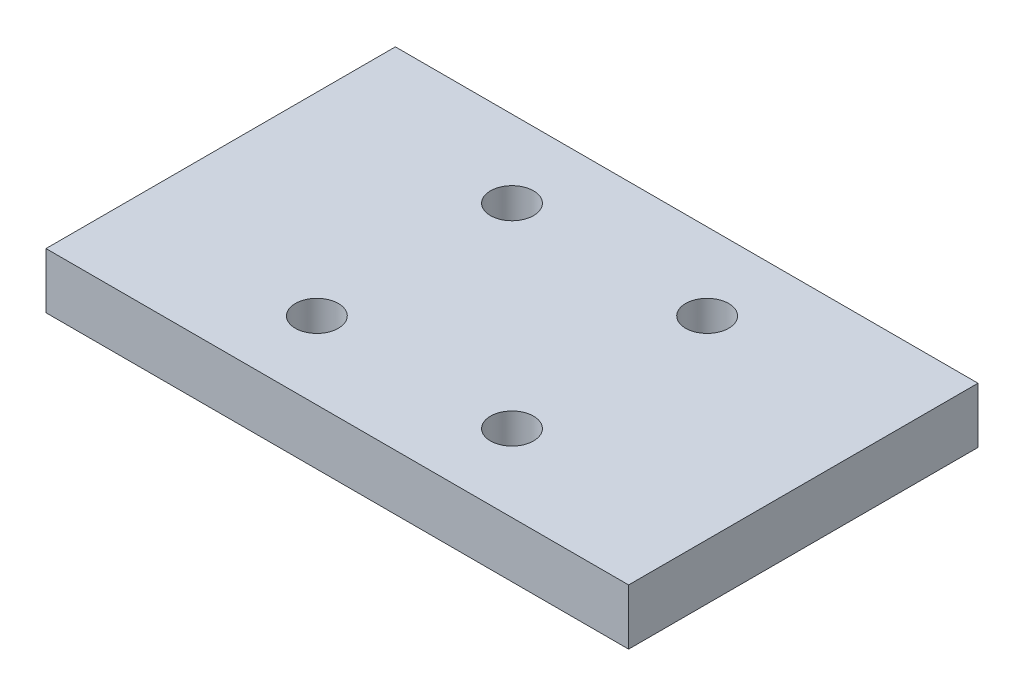
ISO-10303-21;
HEADER;
FILE_DESCRIPTION(('STEP AP214'),'2;1');
FILE_NAME('part.step','',(''),(''),'','','');
FILE_SCHEMA(('AUTOMOTIVE_DESIGN { 1 0 10303 214 1 1 1 1 }'));
ENDSEC;
DATA;
#1=APPLICATION_CONTEXT('core data for automotive mechanical design processes');
#2=APPLICATION_PROTOCOL_DEFINITION('international standard','automotive_design',2000,#1);
#3=PRODUCT_CONTEXT('',#1,'mechanical');
#4=PRODUCT('Part','Part','',(#3));
#5=PRODUCT_RELATED_PRODUCT_CATEGORY('part','',(#4));
#6=PRODUCT_DEFINITION_FORMATION('','',#4);
#7=PRODUCT_DEFINITION_CONTEXT('part definition',#1,'design');
#8=PRODUCT_DEFINITION('design','',#6,#7);
#9=PRODUCT_DEFINITION_SHAPE('','',#8);
#10=(LENGTH_UNIT() NAMED_UNIT(*) SI_UNIT(.MILLI.,.METRE.));
#11=(NAMED_UNIT(*) PLANE_ANGLE_UNIT() SI_UNIT($,.RADIAN.));
#12=(NAMED_UNIT(*) SI_UNIT($,.STERADIAN.) SOLID_ANGLE_UNIT());
#13=UNCERTAINTY_MEASURE_WITH_UNIT(LENGTH_MEASURE(1.E-05),#10,'distance_accuracy_value','');
#14=(GEOMETRIC_REPRESENTATION_CONTEXT(3) GLOBAL_UNCERTAINTY_ASSIGNED_CONTEXT((#13)) GLOBAL_UNIT_ASSIGNED_CONTEXT((#10,
#11,#12)) REPRESENTATION_CONTEXT('',''));
#15=CARTESIAN_POINT('',(0.,0.,0.));
#16=DIRECTION('',(0.,0.,1.));
#17=DIRECTION('',(1.,0.,0.));
#18=AXIS2_PLACEMENT_3D('',#15,#16,#17);
#19=CARTESIAN_POINT('',(33.2502888268469,6.35,-19.939));
#20=DIRECTION('',(-1.,0.,0.));
#21=DIRECTION('',(0.,0.,1.));
#22=AXIS2_PLACEMENT_3D('',#19,#20,#21);
#23=PLANE('',#22);
#24=DIRECTION('',(0.,0.,-1.));
#25=VECTOR('',#24,1.);
#26=CARTESIAN_POINT('',(33.2502888268469,0.,-19.939));
#27=LINE('',#26,#25);
#28=CARTESIAN_POINT('',(33.2502888268469,0.,19.939));
#29=VERTEX_POINT('',#28);
#30=CARTESIAN_POINT('',(33.2502888268469,0.,-19.939));
#31=VERTEX_POINT('',#30);
#32=EDGE_CURVE('E117',#29,#31,#27,.T.);
#33=ORIENTED_EDGE('',*,*,#32,.T.);
#34=DIRECTION('',(0.,-1.,0.));
#35=VECTOR('',#34,1.);
#36=CARTESIAN_POINT('',(33.2502888268469,6.35,-19.939));
#37=LINE('',#36,#35);
#38=CARTESIAN_POINT('',(33.2502888268469,6.35,-19.939));
#39=VERTEX_POINT('',#38);
#40=EDGE_CURVE('E11',#39,#31,#37,.T.);
#41=ORIENTED_EDGE('',*,*,#40,.F.);
#42=DIRECTION('',(0.,0.,-1.));
#43=VECTOR('',#42,1.);
#44=CARTESIAN_POINT('',(33.2502888268469,6.35,-19.939));
#45=LINE('',#44,#43);
#46=CARTESIAN_POINT('',(33.2502888268469,6.35,19.939));
#47=VERTEX_POINT('',#46);
#48=EDGE_CURVE('E101',#47,#39,#45,.T.);
#49=ORIENTED_EDGE('',*,*,#48,.F.);
#50=DIRECTION('',(0.,-1.,0.));
#51=VECTOR('',#50,1.);
#52=CARTESIAN_POINT('',(33.2502888268469,6.35,19.939));
#53=LINE('',#52,#51);
#54=EDGE_CURVE('E113',#47,#29,#53,.T.);
#55=ORIENTED_EDGE('',*,*,#54,.T.);
#56=EDGE_LOOP('',(#33,#41,#49,#55));
#57=FACE_BOUND('',#56,.T.);
#58=ADVANCED_FACE('F45',(#57),#23,.F.);
#59=CARTESIAN_POINT('',(-33.2502888268469,6.35,-19.939));
#60=DIRECTION('',(0.,0.,1.));
#61=DIRECTION('',(1.,0.,0.));
#62=AXIS2_PLACEMENT_3D('',#59,#60,#61);
#63=PLANE('',#62);
#64=DIRECTION('',(-1.,0.,0.));
#65=VECTOR('',#64,1.);
#66=CARTESIAN_POINT('',(-33.2502888268469,0.,-19.939));
#67=LINE('',#66,#65);
#68=CARTESIAN_POINT('',(-33.2502888268469,0.,-19.939));
#69=VERTEX_POINT('',#68);
#70=EDGE_CURVE('E106',#31,#69,#67,.T.);
#71=ORIENTED_EDGE('',*,*,#70,.T.);
#72=DIRECTION('',(0.,-1.,0.));
#73=VECTOR('',#72,1.);
#74=CARTESIAN_POINT('',(-33.2502888268469,6.35,-19.939));
#75=LINE('',#74,#73);
#76=CARTESIAN_POINT('',(-33.2502888268469,6.35,-19.939));
#77=VERTEX_POINT('',#76);
#78=EDGE_CURVE('E54',#77,#69,#75,.T.);
#79=ORIENTED_EDGE('',*,*,#78,.F.);
#80=DIRECTION('',(-1.,0.,0.));
#81=VECTOR('',#80,1.);
#82=CARTESIAN_POINT('',(-33.2502888268469,6.35,-19.939));
#83=LINE('',#82,#81);
#84=EDGE_CURVE('E96',#39,#77,#83,.T.);
#85=ORIENTED_EDGE('',*,*,#84,.F.);
#86=ORIENTED_EDGE('',*,*,#40,.T.);
#87=EDGE_LOOP('',(#71,#79,#85,#86));
#88=FACE_BOUND('',#87,.T.);
#89=ADVANCED_FACE('F105',(#88),#63,.F.);
#90=CARTESIAN_POINT('',(-33.2502888268469,6.35,-19.939));
#91=DIRECTION('',(1.,0.,0.));
#92=DIRECTION('',(0.,0.,-1.));
#93=AXIS2_PLACEMENT_3D('',#90,#91,#92);
#94=PLANE('',#93);
#95=DIRECTION('',(0.,0.,1.));
#96=VECTOR('',#95,1.);
#97=CARTESIAN_POINT('',(-33.2502888268469,0.,-19.939));
#98=LINE('',#97,#96);
#99=CARTESIAN_POINT('',(-33.2502888268469,0.,19.939));
#100=VERTEX_POINT('',#99);
#101=EDGE_CURVE('E83',#69,#100,#98,.T.);
#102=ORIENTED_EDGE('',*,*,#101,.T.);
#103=DIRECTION('',(0.,-1.,0.));
#104=VECTOR('',#103,1.);
#105=CARTESIAN_POINT('',(-33.2502888268469,6.35,19.939));
#106=LINE('',#105,#104);
#107=CARTESIAN_POINT('',(-33.2502888268469,6.35,19.939));
#108=VERTEX_POINT('',#107);
#109=EDGE_CURVE('E108',#108,#100,#106,.T.);
#110=ORIENTED_EDGE('',*,*,#109,.F.);
#111=DIRECTION('',(0.,0.,1.));
#112=VECTOR('',#111,1.);
#113=CARTESIAN_POINT('',(-33.2502888268469,6.35,-19.939));
#114=LINE('',#113,#112);
#115=EDGE_CURVE('E99',#77,#108,#114,.T.);
#116=ORIENTED_EDGE('',*,*,#115,.F.);
#117=ORIENTED_EDGE('',*,*,#78,.T.);
#118=EDGE_LOOP('',(#102,#110,#116,#117));
#119=FACE_BOUND('',#118,.T.);
#120=ADVANCED_FACE('F109',(#119),#94,.F.);
#121=CARTESIAN_POINT('',(-33.2502888268469,6.35,19.939));
#122=DIRECTION('',(0.,0.,-1.));
#123=DIRECTION('',(-1.,0.,0.));
#124=AXIS2_PLACEMENT_3D('',#121,#122,#123);
#125=PLANE('',#124);
#126=DIRECTION('',(1.,0.,0.));
#127=VECTOR('',#126,1.);
#128=CARTESIAN_POINT('',(-33.2502888268469,0.,19.939));
#129=LINE('',#128,#127);
#130=EDGE_CURVE('E89',#100,#29,#129,.T.);
#131=ORIENTED_EDGE('',*,*,#130,.T.);
#132=ORIENTED_EDGE('',*,*,#54,.F.);
#133=DIRECTION('',(1.,0.,0.));
#134=VECTOR('',#133,1.);
#135=CARTESIAN_POINT('',(-33.2502888268469,6.35,19.939));
#136=LINE('',#135,#134);
#137=EDGE_CURVE('E65',#108,#47,#136,.T.);
#138=ORIENTED_EDGE('',*,*,#137,.F.);
#139=ORIENTED_EDGE('',*,*,#109,.T.);
#140=EDGE_LOOP('',(#131,#132,#138,#139));
#141=FACE_BOUND('',#140,.T.);
#142=ADVANCED_FACE('F131',(#141),#125,.F.);
#143=CARTESIAN_POINT('',(0.,6.35,0.));
#144=DIRECTION('',(0.,1.,0.));
#145=DIRECTION('',(0.,0.,1.));
#146=AXIS2_PLACEMENT_3D('',#143,#144,#145);
#147=PLANE('',#146);
#148=CARTESIAN_POINT('',(11.1369318036951,6.35,-11.1369318036878));
#149=DIRECTION('',(0.,-1.,0.));
#150=DIRECTION('',(0.,0.,-1.));
#151=AXIS2_PLACEMENT_3D('',#148,#149,#150);
#152=CIRCLE('',#151,2.45745);
#153=CARTESIAN_POINT('',(11.1369318036951,6.35,-13.5943818036878));
#154=VERTEX_POINT('',#153);
#155=EDGE_CURVE('E173',#154,#154,#152,.T.);
#156=ORIENTED_EDGE('',*,*,#155,.T.);
#157=EDGE_LOOP('',(#156));
#158=FACE_BOUND('',#157,.T.);
#159=CARTESIAN_POINT('',(-11.1369318036811,6.35,-11.1369318036878));
#160=DIRECTION('',(0.,-1.,0.));
#161=DIRECTION('',(0.,0.,-1.));
#162=AXIS2_PLACEMENT_3D('',#159,#160,#161);
#163=CIRCLE('',#162,2.45745);
#164=CARTESIAN_POINT('',(-11.1369318036811,6.35,-13.5943818036878));
#165=VERTEX_POINT('',#164);
#166=EDGE_CURVE('E161',#165,#165,#163,.T.);
#167=ORIENTED_EDGE('',*,*,#166,.T.);
#168=EDGE_LOOP('',(#167));
#169=FACE_BOUND('',#168,.T.);
#170=CARTESIAN_POINT('',(-11.1369318036811,6.35,11.1369318036885));
#171=DIRECTION('',(0.,-1.,0.));
#172=DIRECTION('',(0.,0.,-1.));
#173=AXIS2_PLACEMENT_3D('',#170,#171,#172);
#174=CIRCLE('',#173,2.45745);
#175=CARTESIAN_POINT('',(-11.1369318036811,6.35,8.67948180368847));
#176=VERTEX_POINT('',#175);
#177=EDGE_CURVE('E149',#176,#176,#174,.T.);
#178=ORIENTED_EDGE('',*,*,#177,.T.);
#179=EDGE_LOOP('',(#178));
#180=FACE_BOUND('',#179,.T.);
#181=CARTESIAN_POINT('',(11.1369318036951,6.35,11.1369318036885));
#182=DIRECTION('',(0.,-1.,0.));
#183=DIRECTION('',(0.,0.,-1.));
#184=AXIS2_PLACEMENT_3D('',#181,#182,#183);
#185=CIRCLE('',#184,2.45745);
#186=CARTESIAN_POINT('',(11.1369318036951,6.35,8.67948180368847));
#187=VERTEX_POINT('',#186);
#188=EDGE_CURVE('E121',#187,#187,#185,.T.);
#189=ORIENTED_EDGE('',*,*,#188,.T.);
#190=EDGE_LOOP('',(#189));
#191=FACE_BOUND('',#190,.T.);
#192=ORIENTED_EDGE('',*,*,#48,.T.);
#193=ORIENTED_EDGE('',*,*,#84,.T.);
#194=ORIENTED_EDGE('',*,*,#115,.T.);
#195=ORIENTED_EDGE('',*,*,#137,.T.);
#196=EDGE_LOOP('',(#192,#193,#194,#195));
#197=FACE_BOUND('',#196,.T.);
#198=ADVANCED_FACE('F97',(#158,#169,#180,#191,#197),#147,.T.);
#199=CARTESIAN_POINT('',(0.,0.,0.));
#200=DIRECTION('',(0.,1.,0.));
#201=DIRECTION('',(0.,0.,1.));
#202=AXIS2_PLACEMENT_3D('',#199,#200,#201);
#203=PLANE('',#202);
#204=CARTESIAN_POINT('',(11.1369318036951,0.,-11.1369318036878));
#205=DIRECTION('',(0.,-1.,0.));
#206=DIRECTION('',(0.,0.,-1.));
#207=AXIS2_PLACEMENT_3D('',#204,#205,#206);
#208=CIRCLE('',#207,3.09245);
#209=CARTESIAN_POINT('',(11.1369318036951,0.,-14.2293818036878));
#210=VERTEX_POINT('',#209);
#211=EDGE_CURVE('E181',#210,#210,#208,.T.);
#212=ORIENTED_EDGE('',*,*,#211,.F.);
#213=EDGE_LOOP('',(#212));
#214=FACE_BOUND('',#213,.T.);
#215=CARTESIAN_POINT('',(-11.1369318036811,0.,-11.1369318036878));
#216=DIRECTION('',(0.,-1.,0.));
#217=DIRECTION('',(0.,0.,-1.));
#218=AXIS2_PLACEMENT_3D('',#215,#216,#217);
#219=CIRCLE('',#218,3.09245);
#220=CARTESIAN_POINT('',(-11.1369318036811,0.,-14.2293818036878));
#221=VERTEX_POINT('',#220);
#222=EDGE_CURVE('E169',#221,#221,#219,.T.);
#223=ORIENTED_EDGE('',*,*,#222,.F.);
#224=EDGE_LOOP('',(#223));
#225=FACE_BOUND('',#224,.T.);
#226=CARTESIAN_POINT('',(-11.1369318036811,0.,11.1369318036885));
#227=DIRECTION('',(0.,-1.,0.));
#228=DIRECTION('',(0.,0.,-1.));
#229=AXIS2_PLACEMENT_3D('',#226,#227,#228);
#230=CIRCLE('',#229,3.09245);
#231=CARTESIAN_POINT('',(-11.1369318036811,0.,8.04448180368847));
#232=VERTEX_POINT('',#231);
#233=EDGE_CURVE('E157',#232,#232,#230,.T.);
#234=ORIENTED_EDGE('',*,*,#233,.F.);
#235=EDGE_LOOP('',(#234));
#236=FACE_BOUND('',#235,.T.);
#237=CARTESIAN_POINT('',(11.1369318036951,0.,11.1369318036885));
#238=DIRECTION('',(0.,-1.,0.));
#239=DIRECTION('',(0.,0.,-1.));
#240=AXIS2_PLACEMENT_3D('',#237,#238,#239);
#241=CIRCLE('',#240,3.09245);
#242=CARTESIAN_POINT('',(11.1369318036951,0.,8.04448180368847));
#243=VERTEX_POINT('',#242);
#244=EDGE_CURVE('E145',#243,#243,#241,.T.);
#245=ORIENTED_EDGE('',*,*,#244,.F.);
#246=EDGE_LOOP('',(#245));
#247=FACE_BOUND('',#246,.T.);
#248=ORIENTED_EDGE('',*,*,#32,.F.);
#249=ORIENTED_EDGE('',*,*,#130,.F.);
#250=ORIENTED_EDGE('',*,*,#101,.F.);
#251=ORIENTED_EDGE('',*,*,#70,.F.);
#252=EDGE_LOOP('',(#248,#249,#250,#251));
#253=FACE_BOUND('',#252,.T.);
#254=ADVANCED_FACE('F134',(#214,#225,#236,#247,#253),#203,.F.);
#255=CARTESIAN_POINT('',(11.1369318036951,0.,11.1369318036885));
#256=DIRECTION('',(0.,-1.,0.));
#257=DIRECTION('',(0.,0.,-1.));
#258=AXIS2_PLACEMENT_3D('',#255,#256,#257);
#259=CYLINDRICAL_SURFACE('',#258,2.45745);
#260=ORIENTED_EDGE('',*,*,#188,.F.);
#261=EDGE_LOOP('',(#260));
#262=FACE_BOUND('',#261,.T.);
#263=CARTESIAN_POINT('',(11.1369318036951,0.635,11.1369318036885));
#264=DIRECTION('',(0.,-1.,0.));
#265=DIRECTION('',(0.,0.,-1.));
#266=AXIS2_PLACEMENT_3D('',#263,#264,#265);
#267=CIRCLE('',#266,2.45745);
#268=CARTESIAN_POINT('',(11.1369318036951,0.635,8.67948180368847));
#269=VERTEX_POINT('',#268);
#270=EDGE_CURVE('E141',#269,#269,#267,.T.);
#271=ORIENTED_EDGE('',*,*,#270,.T.);
#272=EDGE_LOOP('',(#271));
#273=FACE_BOUND('',#272,.T.);
#274=ADVANCED_FACE('F190',(#262,#273),#259,.F.);
#275=CARTESIAN_POINT('',(11.1369318036951,0.,11.1369318036885));
#276=DIRECTION('',(0.,-1.,0.));
#277=DIRECTION('',(0.,0.,-1.));
#278=AXIS2_PLACEMENT_3D('',#275,#276,#277);
#279=CONICAL_SURFACE('',#278,3.09245,0.785398163397447);
#280=ORIENTED_EDGE('',*,*,#270,.F.);
#281=EDGE_LOOP('',(#280));
#282=FACE_BOUND('',#281,.T.);
#283=ORIENTED_EDGE('',*,*,#244,.T.);
#284=EDGE_LOOP('',(#283));
#285=FACE_BOUND('',#284,.T.);
#286=ADVANCED_FACE('F198',(#282,#285),#279,.F.);
#287=CARTESIAN_POINT('',(-11.1369318036811,0.,11.1369318036885));
#288=DIRECTION('',(0.,-1.,0.));
#289=DIRECTION('',(0.,0.,-1.));
#290=AXIS2_PLACEMENT_3D('',#287,#288,#289);
#291=CYLINDRICAL_SURFACE('',#290,2.45745);
#292=ORIENTED_EDGE('',*,*,#177,.F.);
#293=EDGE_LOOP('',(#292));
#294=FACE_BOUND('',#293,.T.);
#295=CARTESIAN_POINT('',(-11.1369318036811,0.635,11.1369318036885));
#296=DIRECTION('',(0.,-1.,0.));
#297=DIRECTION('',(0.,0.,-1.));
#298=AXIS2_PLACEMENT_3D('',#295,#296,#297);
#299=CIRCLE('',#298,2.45745);
#300=CARTESIAN_POINT('',(-11.1369318036811,0.635,8.67948180368847));
#301=VERTEX_POINT('',#300);
#302=EDGE_CURVE('E153',#301,#301,#299,.T.);
#303=ORIENTED_EDGE('',*,*,#302,.T.);
#304=EDGE_LOOP('',(#303));
#305=FACE_BOUND('',#304,.T.);
#306=ADVANCED_FACE('F200',(#294,#305),#291,.F.);
#307=CARTESIAN_POINT('',(-11.1369318036811,0.,11.1369318036885));
#308=DIRECTION('',(0.,-1.,0.));
#309=DIRECTION('',(0.,0.,-1.));
#310=AXIS2_PLACEMENT_3D('',#307,#308,#309);
#311=CONICAL_SURFACE('',#310,3.09245,0.785398163397447);
#312=ORIENTED_EDGE('',*,*,#302,.F.);
#313=EDGE_LOOP('',(#312));
#314=FACE_BOUND('',#313,.T.);
#315=ORIENTED_EDGE('',*,*,#233,.T.);
#316=EDGE_LOOP('',(#315));
#317=FACE_BOUND('',#316,.T.);
#318=ADVANCED_FACE('F207',(#314,#317),#311,.F.);
#319=CARTESIAN_POINT('',(-11.1369318036811,0.,-11.1369318036878));
#320=DIRECTION('',(0.,-1.,0.));
#321=DIRECTION('',(0.,0.,-1.));
#322=AXIS2_PLACEMENT_3D('',#319,#320,#321);
#323=CYLINDRICAL_SURFACE('',#322,2.45745);
#324=ORIENTED_EDGE('',*,*,#166,.F.);
#325=EDGE_LOOP('',(#324));
#326=FACE_BOUND('',#325,.T.);
#327=CARTESIAN_POINT('',(-11.1369318036811,0.635,-11.1369318036878));
#328=DIRECTION('',(0.,-1.,0.));
#329=DIRECTION('',(0.,0.,-1.));
#330=AXIS2_PLACEMENT_3D('',#327,#328,#329);
#331=CIRCLE('',#330,2.45745);
#332=CARTESIAN_POINT('',(-11.1369318036811,0.635,-13.5943818036878));
#333=VERTEX_POINT('',#332);
#334=EDGE_CURVE('E165',#333,#333,#331,.T.);
#335=ORIENTED_EDGE('',*,*,#334,.T.);
#336=EDGE_LOOP('',(#335));
#337=FACE_BOUND('',#336,.T.);
#338=ADVANCED_FACE('F241',(#326,#337),#323,.F.);
#339=CARTESIAN_POINT('',(-11.1369318036811,0.,-11.1369318036878));
#340=DIRECTION('',(0.,-1.,0.));
#341=DIRECTION('',(0.,0.,-1.));
#342=AXIS2_PLACEMENT_3D('',#339,#340,#341);
#343=CONICAL_SURFACE('',#342,3.09245,0.785398163397447);
#344=ORIENTED_EDGE('',*,*,#334,.F.);
#345=EDGE_LOOP('',(#344));
#346=FACE_BOUND('',#345,.T.);
#347=ORIENTED_EDGE('',*,*,#222,.T.);
#348=EDGE_LOOP('',(#347));
#349=FACE_BOUND('',#348,.T.);
#350=ADVANCED_FACE('F246',(#346,#349),#343,.F.);
#351=CARTESIAN_POINT('',(11.1369318036951,0.,-11.1369318036878));
#352=DIRECTION('',(0.,-1.,0.));
#353=DIRECTION('',(0.,0.,-1.));
#354=AXIS2_PLACEMENT_3D('',#351,#352,#353);
#355=CYLINDRICAL_SURFACE('',#354,2.45745);
#356=ORIENTED_EDGE('',*,*,#155,.F.);
#357=EDGE_LOOP('',(#356));
#358=FACE_BOUND('',#357,.T.);
#359=CARTESIAN_POINT('',(11.1369318036951,0.635,-11.1369318036878));
#360=DIRECTION('',(0.,-1.,0.));
#361=DIRECTION('',(0.,0.,-1.));
#362=AXIS2_PLACEMENT_3D('',#359,#360,#361);
#363=CIRCLE('',#362,2.45745);
#364=CARTESIAN_POINT('',(11.1369318036951,0.635,-13.5943818036878));
#365=VERTEX_POINT('',#364);
#366=EDGE_CURVE('E177',#365,#365,#363,.T.);
#367=ORIENTED_EDGE('',*,*,#366,.T.);
#368=EDGE_LOOP('',(#367));
#369=FACE_BOUND('',#368,.T.);
#370=ADVANCED_FACE('F252',(#358,#369),#355,.F.);
#371=CARTESIAN_POINT('',(11.1369318036951,0.,-11.1369318036878));
#372=DIRECTION('',(0.,-1.,0.));
#373=DIRECTION('',(0.,0.,-1.));
#374=AXIS2_PLACEMENT_3D('',#371,#372,#373);
#375=CONICAL_SURFACE('',#374,3.09245,0.785398163397447);
#376=ORIENTED_EDGE('',*,*,#366,.F.);
#377=EDGE_LOOP('',(#376));
#378=FACE_BOUND('',#377,.T.);
#379=ORIENTED_EDGE('',*,*,#211,.T.);
#380=EDGE_LOOP('',(#379));
#381=FACE_BOUND('',#380,.T.);
#382=ADVANCED_FACE('F186',(#378,#381),#375,.F.);
#383=CLOSED_SHELL('',(#58,#89,#120,#142,#198,#254,#274,#286,#306,#318,#338,#350,#370,#382));
#384=MANIFOLD_SOLID_BREP('B2',#383);
#385=ADVANCED_BREP_SHAPE_REPRESENTATION('',(#18,#384),#14);
#386=SHAPE_DEFINITION_REPRESENTATION(#9,#385);
ENDSEC;
END-ISO-10303-21;
